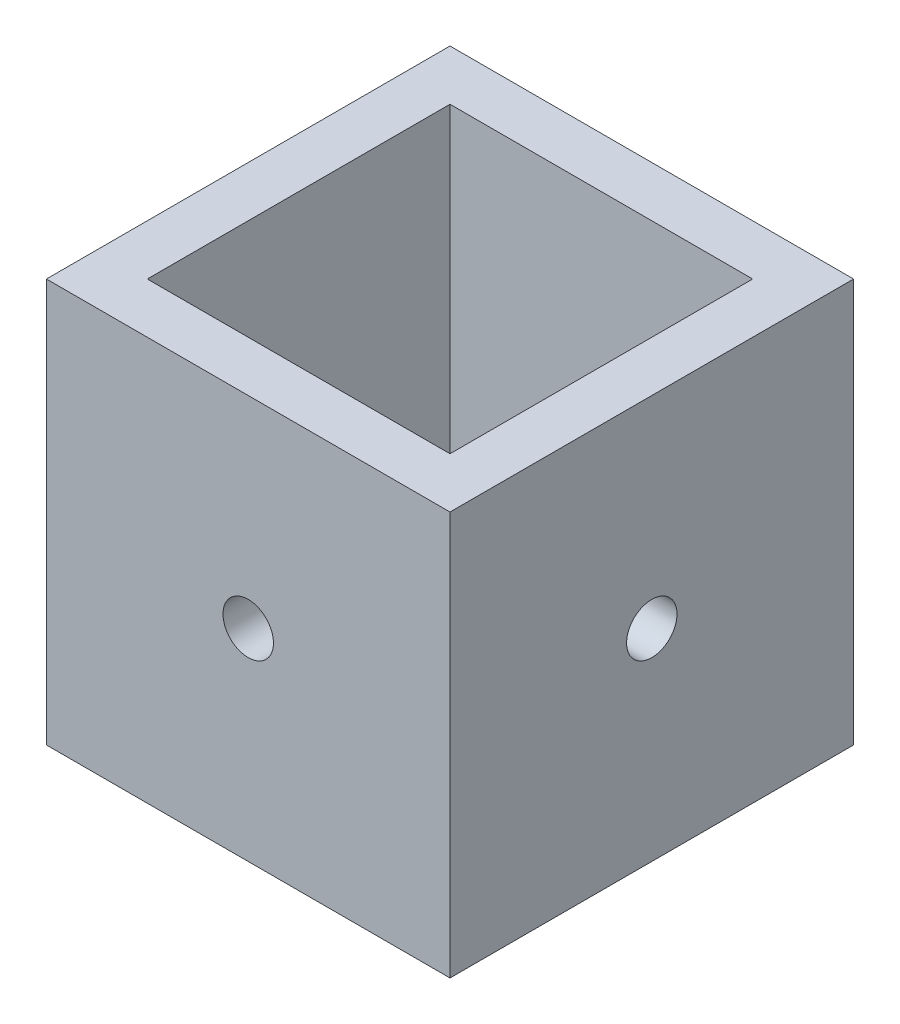
ISO-10303-21;
HEADER;
FILE_DESCRIPTION(('STEP AP214'),'2;1');
FILE_NAME('part.step','',(''),(''),'','','');
FILE_SCHEMA(('AUTOMOTIVE_DESIGN { 1 0 10303 214 1 1 1 1 }'));
ENDSEC;
DATA;
#1=APPLICATION_CONTEXT('core data for automotive mechanical design processes');
#2=APPLICATION_PROTOCOL_DEFINITION('international standard','automotive_design',2000,#1);
#3=PRODUCT_CONTEXT('',#1,'mechanical');
#4=PRODUCT('Part','Part','',(#3));
#5=PRODUCT_RELATED_PRODUCT_CATEGORY('part','',(#4));
#6=PRODUCT_DEFINITION_FORMATION('','',#4);
#7=PRODUCT_DEFINITION_CONTEXT('part definition',#1,'design');
#8=PRODUCT_DEFINITION('design','',#6,#7);
#9=PRODUCT_DEFINITION_SHAPE('','',#8);
#10=(LENGTH_UNIT() NAMED_UNIT(*) SI_UNIT(.MILLI.,.METRE.));
#11=(NAMED_UNIT(*) PLANE_ANGLE_UNIT() SI_UNIT($,.RADIAN.));
#12=(NAMED_UNIT(*) SI_UNIT($,.STERADIAN.) SOLID_ANGLE_UNIT());
#13=UNCERTAINTY_MEASURE_WITH_UNIT(LENGTH_MEASURE(1.E-05),#10,'distance_accuracy_value','');
#14=(GEOMETRIC_REPRESENTATION_CONTEXT(3) GLOBAL_UNCERTAINTY_ASSIGNED_CONTEXT((#13)) GLOBAL_UNIT_ASSIGNED_CONTEXT((#10,
#11,#12)) REPRESENTATION_CONTEXT('',''));
#15=CARTESIAN_POINT('',(0.,0.,0.));
#16=DIRECTION('',(0.,0.,1.));
#17=DIRECTION('',(1.,0.,0.));
#18=AXIS2_PLACEMENT_3D('',#15,#16,#17);
#19=CARTESIAN_POINT('',(0.,25.4,0.));
#20=DIRECTION('',(0.,1.,0.));
#21=DIRECTION('',(0.,0.,1.));
#22=AXIS2_PLACEMENT_3D('',#19,#20,#21);
#23=PLANE('',#22);
#24=DIRECTION('',(0.,0.,1.));
#25=VECTOR('',#24,1.);
#26=CARTESIAN_POINT('',(-12.7,25.4,12.7));
#27=LINE('',#26,#25);
#28=CARTESIAN_POINT('',(-12.7,25.4,-12.7));
#29=VERTEX_POINT('',#28);
#30=CARTESIAN_POINT('',(-12.7,25.4,12.7));
#31=VERTEX_POINT('',#30);
#32=EDGE_CURVE('E157',#29,#31,#27,.T.);
#33=ORIENTED_EDGE('',*,*,#32,.T.);
#34=DIRECTION('',(1.,0.,0.));
#35=VECTOR('',#34,1.);
#36=CARTESIAN_POINT('',(12.7,25.4,12.7));
#37=LINE('',#36,#35);
#38=CARTESIAN_POINT('',(12.7,25.4,12.7));
#39=VERTEX_POINT('',#38);
#40=EDGE_CURVE('E161',#31,#39,#37,.T.);
#41=ORIENTED_EDGE('',*,*,#40,.T.);
#42=DIRECTION('',(0.,0.,-1.));
#43=VECTOR('',#42,1.);
#44=CARTESIAN_POINT('',(12.7,25.4,12.7));
#45=LINE('',#44,#43);
#46=CARTESIAN_POINT('',(12.7,25.4,-12.7));
#47=VERTEX_POINT('',#46);
#48=EDGE_CURVE('E165',#39,#47,#45,.T.);
#49=ORIENTED_EDGE('',*,*,#48,.T.);
#50=DIRECTION('',(-1.,0.,0.));
#51=VECTOR('',#50,1.);
#52=CARTESIAN_POINT('',(12.7,25.4,-12.7));
#53=LINE('',#52,#51);
#54=EDGE_CURVE('E168',#47,#29,#53,.T.);
#55=ORIENTED_EDGE('',*,*,#54,.T.);
#56=EDGE_LOOP('',(#33,#41,#49,#55));
#57=FACE_BOUND('',#56,.T.);
#58=DIRECTION('',(1.,0.,0.));
#59=VECTOR('',#58,1.);
#60=CARTESIAN_POINT('',(9.52500000000001,25.4,9.525));
#61=LINE('',#60,#59);
#62=CARTESIAN_POINT('',(-9.525,25.4,9.52500000000001));
#63=VERTEX_POINT('',#62);
#64=CARTESIAN_POINT('',(9.52500000000001,25.4,9.525));
#65=VERTEX_POINT('',#64);
#66=EDGE_CURVE('E116',#63,#65,#61,.T.);
#67=ORIENTED_EDGE('',*,*,#66,.F.);
#68=DIRECTION('',(0.,0.,1.));
#69=VECTOR('',#68,1.);
#70=CARTESIAN_POINT('',(-9.525,25.4,9.52500000000001));
#71=LINE('',#70,#69);
#72=CARTESIAN_POINT('',(-9.525,25.4,-9.525));
#73=VERTEX_POINT('',#72);
#74=EDGE_CURVE('E107',#73,#63,#71,.T.);
#75=ORIENTED_EDGE('',*,*,#74,.F.);
#76=DIRECTION('',(-1.,0.,0.));
#77=VECTOR('',#76,1.);
#78=CARTESIAN_POINT('',(9.525,25.4,-9.525));
#79=LINE('',#78,#77);
#80=CARTESIAN_POINT('',(9.525,25.4,-9.525));
#81=VERTEX_POINT('',#80);
#82=EDGE_CURVE('E133',#81,#73,#79,.T.);
#83=ORIENTED_EDGE('',*,*,#82,.F.);
#84=DIRECTION('',(0.,0.,-1.));
#85=VECTOR('',#84,1.);
#86=CARTESIAN_POINT('',(9.52500000000001,25.4,9.525));
#87=LINE('',#86,#85);
#88=EDGE_CURVE('E129',#65,#81,#87,.T.);
#89=ORIENTED_EDGE('',*,*,#88,.F.);
#90=EDGE_LOOP('',(#67,#75,#83,#89));
#91=FACE_BOUND('',#90,.T.);
#92=ADVANCED_FACE('F39',(#57,#91),#23,.T.);
#93=CARTESIAN_POINT('',(0.,0.,0.));
#94=DIRECTION('',(0.,1.,0.));
#95=DIRECTION('',(0.,0.,1.));
#96=AXIS2_PLACEMENT_3D('',#93,#94,#95);
#97=PLANE('',#96);
#98=DIRECTION('',(0.,0.,1.));
#99=VECTOR('',#98,1.);
#100=CARTESIAN_POINT('',(-12.7,0.,12.7));
#101=LINE('',#100,#99);
#102=CARTESIAN_POINT('',(-12.7,0.,-12.7));
#103=VERTEX_POINT('',#102);
#104=CARTESIAN_POINT('',(-12.7,0.,12.7));
#105=VERTEX_POINT('',#104);
#106=EDGE_CURVE('E125',#103,#105,#101,.T.);
#107=ORIENTED_EDGE('',*,*,#106,.F.);
#108=DIRECTION('',(-1.,0.,0.));
#109=VECTOR('',#108,1.);
#110=CARTESIAN_POINT('',(12.7,0.,-12.7));
#111=LINE('',#110,#109);
#112=CARTESIAN_POINT('',(12.7,0.,-12.7));
#113=VERTEX_POINT('',#112);
#114=EDGE_CURVE('E162',#113,#103,#111,.T.);
#115=ORIENTED_EDGE('',*,*,#114,.F.);
#116=DIRECTION('',(0.,0.,-1.));
#117=VECTOR('',#116,1.);
#118=CARTESIAN_POINT('',(12.7,0.,12.7));
#119=LINE('',#118,#117);
#120=CARTESIAN_POINT('',(12.7,0.,12.7));
#121=VERTEX_POINT('',#120);
#122=EDGE_CURVE('E178',#121,#113,#119,.T.);
#123=ORIENTED_EDGE('',*,*,#122,.F.);
#124=DIRECTION('',(1.,0.,0.));
#125=VECTOR('',#124,1.);
#126=CARTESIAN_POINT('',(12.7,0.,12.7));
#127=LINE('',#126,#125);
#128=EDGE_CURVE('E175',#105,#121,#127,.T.);
#129=ORIENTED_EDGE('',*,*,#128,.F.);
#130=EDGE_LOOP('',(#107,#115,#123,#129));
#131=FACE_BOUND('',#130,.T.);
#132=DIRECTION('',(0.,0.,1.));
#133=VECTOR('',#132,1.);
#134=CARTESIAN_POINT('',(-9.525,0.,9.52500000000001));
#135=LINE('',#134,#133);
#136=CARTESIAN_POINT('',(-9.525,0.,-9.525));
#137=VERTEX_POINT('',#136);
#138=CARTESIAN_POINT('',(-9.525,0.,9.52500000000001));
#139=VERTEX_POINT('',#138);
#140=EDGE_CURVE('E65',#137,#139,#135,.T.);
#141=ORIENTED_EDGE('',*,*,#140,.T.);
#142=DIRECTION('',(1.,0.,0.));
#143=VECTOR('',#142,1.);
#144=CARTESIAN_POINT('',(9.52500000000001,0.,9.525));
#145=LINE('',#144,#143);
#146=CARTESIAN_POINT('',(9.52500000000001,0.,9.525));
#147=VERTEX_POINT('',#146);
#148=EDGE_CURVE('E123',#139,#147,#145,.T.);
#149=ORIENTED_EDGE('',*,*,#148,.T.);
#150=DIRECTION('',(0.,0.,-1.));
#151=VECTOR('',#150,1.);
#152=CARTESIAN_POINT('',(9.52500000000001,0.,9.525));
#153=LINE('',#152,#151);
#154=CARTESIAN_POINT('',(9.525,0.,-9.525));
#155=VERTEX_POINT('',#154);
#156=EDGE_CURVE('E144',#147,#155,#153,.T.);
#157=ORIENTED_EDGE('',*,*,#156,.T.);
#158=DIRECTION('',(-1.,0.,0.));
#159=VECTOR('',#158,1.);
#160=CARTESIAN_POINT('',(9.525,0.,-9.525));
#161=LINE('',#160,#159);
#162=EDGE_CURVE('E117',#155,#137,#161,.T.);
#163=ORIENTED_EDGE('',*,*,#162,.T.);
#164=EDGE_LOOP('',(#141,#149,#157,#163));
#165=FACE_BOUND('',#164,.T.);
#166=ADVANCED_FACE('F236',(#131,#165),#97,.F.);
#167=CARTESIAN_POINT('',(-12.7,25.4,12.7));
#168=DIRECTION('',(1.,0.,0.));
#169=DIRECTION('',(0.,0.,-1.));
#170=AXIS2_PLACEMENT_3D('',#167,#168,#169);
#171=PLANE('',#170);
#172=CARTESIAN_POINT('',(-12.7,12.7,0.));
#173=DIRECTION('',(1.,0.,0.));
#174=DIRECTION('',(0.,0.,-1.));
#175=AXIS2_PLACEMENT_3D('',#172,#173,#174);
#176=CIRCLE('',#175,1.5875);
#177=CARTESIAN_POINT('',(-12.7,12.7,-1.5875));
#178=VERTEX_POINT('',#177);
#179=EDGE_CURVE('E204',#178,#178,#176,.T.);
#180=ORIENTED_EDGE('',*,*,#179,.T.);
#181=EDGE_LOOP('',(#180));
#182=FACE_BOUND('',#181,.T.);
#183=ORIENTED_EDGE('',*,*,#106,.T.);
#184=DIRECTION('',(0.,-1.,0.));
#185=VECTOR('',#184,1.);
#186=CARTESIAN_POINT('',(-12.7,25.4,12.7));
#187=LINE('',#186,#185);
#188=EDGE_CURVE('E11',#31,#105,#187,.T.);
#189=ORIENTED_EDGE('',*,*,#188,.F.);
#190=ORIENTED_EDGE('',*,*,#32,.F.);
#191=DIRECTION('',(0.,-1.,0.));
#192=VECTOR('',#191,1.);
#193=CARTESIAN_POINT('',(-12.7,25.4,-12.7));
#194=LINE('',#193,#192);
#195=EDGE_CURVE('E171',#29,#103,#194,.T.);
#196=ORIENTED_EDGE('',*,*,#195,.T.);
#197=EDGE_LOOP('',(#183,#189,#190,#196));
#198=FACE_BOUND('',#197,.T.);
#199=ADVANCED_FACE('F41',(#182,#198),#171,.F.);
#200=CARTESIAN_POINT('',(12.7,25.4,12.7));
#201=DIRECTION('',(0.,0.,-1.));
#202=DIRECTION('',(-1.,0.,0.));
#203=AXIS2_PLACEMENT_3D('',#200,#201,#202);
#204=PLANE('',#203);
#205=CARTESIAN_POINT('',(0.,12.7,12.7));
#206=DIRECTION('',(0.,0.,1.));
#207=DIRECTION('',(1.,0.,0.));
#208=AXIS2_PLACEMENT_3D('',#205,#206,#207);
#209=CIRCLE('',#208,1.5875);
#210=CARTESIAN_POINT('',(1.5875,12.7,12.7));
#211=VERTEX_POINT('',#210);
#212=EDGE_CURVE('E196',#211,#211,#209,.T.);
#213=ORIENTED_EDGE('',*,*,#212,.F.);
#214=EDGE_LOOP('',(#213));
#215=FACE_BOUND('',#214,.T.);
#216=ORIENTED_EDGE('',*,*,#128,.T.);
#217=DIRECTION('',(0.,-1.,0.));
#218=VECTOR('',#217,1.);
#219=CARTESIAN_POINT('',(12.7,25.4,12.7));
#220=LINE('',#219,#218);
#221=EDGE_CURVE('E49',#39,#121,#220,.T.);
#222=ORIENTED_EDGE('',*,*,#221,.F.);
#223=ORIENTED_EDGE('',*,*,#40,.F.);
#224=ORIENTED_EDGE('',*,*,#188,.T.);
#225=EDGE_LOOP('',(#216,#222,#223,#224));
#226=FACE_BOUND('',#225,.T.);
#227=ADVANCED_FACE('F251',(#215,#226),#204,.F.);
#228=CARTESIAN_POINT('',(12.7,25.4,12.7));
#229=DIRECTION('',(-1.,0.,0.));
#230=DIRECTION('',(0.,0.,1.));
#231=AXIS2_PLACEMENT_3D('',#228,#229,#230);
#232=PLANE('',#231);
#233=CARTESIAN_POINT('',(12.7,12.7,0.));
#234=DIRECTION('',(1.,0.,0.));
#235=DIRECTION('',(0.,0.,-1.));
#236=AXIS2_PLACEMENT_3D('',#233,#234,#235);
#237=CIRCLE('',#236,1.5875);
#238=CARTESIAN_POINT('',(12.7,12.7,-1.5875));
#239=VERTEX_POINT('',#238);
#240=EDGE_CURVE('E286',#239,#239,#237,.T.);
#241=ORIENTED_EDGE('',*,*,#240,.F.);
#242=EDGE_LOOP('',(#241));
#243=FACE_BOUND('',#242,.T.);
#244=ORIENTED_EDGE('',*,*,#122,.T.);
#245=DIRECTION('',(0.,-1.,0.));
#246=VECTOR('',#245,1.);
#247=CARTESIAN_POINT('',(12.7,25.4,-12.7));
#248=LINE('',#247,#246);
#249=EDGE_CURVE('E186',#47,#113,#248,.T.);
#250=ORIENTED_EDGE('',*,*,#249,.F.);
#251=ORIENTED_EDGE('',*,*,#48,.F.);
#252=ORIENTED_EDGE('',*,*,#221,.T.);
#253=EDGE_LOOP('',(#244,#250,#251,#252));
#254=FACE_BOUND('',#253,.T.);
#255=ADVANCED_FACE('F249',(#243,#254),#232,.F.);
#256=CARTESIAN_POINT('',(12.7,25.4,-12.7));
#257=DIRECTION('',(0.,0.,1.));
#258=DIRECTION('',(1.,0.,0.));
#259=AXIS2_PLACEMENT_3D('',#256,#257,#258);
#260=PLANE('',#259);
#261=CARTESIAN_POINT('',(0.,12.7,-12.7));
#262=DIRECTION('',(0.,0.,1.));
#263=DIRECTION('',(1.,0.,0.));
#264=AXIS2_PLACEMENT_3D('',#261,#262,#263);
#265=CIRCLE('',#264,1.5875);
#266=CARTESIAN_POINT('',(1.5875,12.7,-12.7));
#267=VERTEX_POINT('',#266);
#268=EDGE_CURVE('E141',#267,#267,#265,.T.);
#269=ORIENTED_EDGE('',*,*,#268,.T.);
#270=EDGE_LOOP('',(#269));
#271=FACE_BOUND('',#270,.T.);
#272=ORIENTED_EDGE('',*,*,#114,.T.);
#273=ORIENTED_EDGE('',*,*,#195,.F.);
#274=ORIENTED_EDGE('',*,*,#54,.F.);
#275=ORIENTED_EDGE('',*,*,#249,.T.);
#276=EDGE_LOOP('',(#272,#273,#274,#275));
#277=FACE_BOUND('',#276,.T.);
#278=ADVANCED_FACE('F217',(#271,#277),#260,.F.);
#279=CARTESIAN_POINT('',(-9.525,25.4,9.52500000000001));
#280=DIRECTION('',(1.,0.,0.));
#281=DIRECTION('',(0.,0.,-1.));
#282=AXIS2_PLACEMENT_3D('',#279,#280,#281);
#283=PLANE('',#282);
#284=CARTESIAN_POINT('',(-9.525,12.7,0.));
#285=DIRECTION('',(1.,0.,0.));
#286=DIRECTION('',(0.,0.,-1.));
#287=AXIS2_PLACEMENT_3D('',#284,#285,#286);
#288=CIRCLE('',#287,1.5875);
#289=CARTESIAN_POINT('',(-9.525,12.7,-1.5875));
#290=VERTEX_POINT('',#289);
#291=EDGE_CURVE('E210',#290,#290,#288,.T.);
#292=ORIENTED_EDGE('',*,*,#291,.F.);
#293=EDGE_LOOP('',(#292));
#294=FACE_BOUND('',#293,.T.);
#295=ORIENTED_EDGE('',*,*,#140,.F.);
#296=DIRECTION('',(0.,-1.,0.));
#297=VECTOR('',#296,1.);
#298=CARTESIAN_POINT('',(-9.525,25.4,-9.525));
#299=LINE('',#298,#297);
#300=EDGE_CURVE('E111',#73,#137,#299,.T.);
#301=ORIENTED_EDGE('',*,*,#300,.F.);
#302=ORIENTED_EDGE('',*,*,#74,.T.);
#303=DIRECTION('',(0.,-1.,0.));
#304=VECTOR('',#303,1.);
#305=CARTESIAN_POINT('',(-9.525,25.4,9.52500000000001));
#306=LINE('',#305,#304);
#307=EDGE_CURVE('E110',#63,#139,#306,.T.);
#308=ORIENTED_EDGE('',*,*,#307,.T.);
#309=EDGE_LOOP('',(#295,#301,#302,#308));
#310=FACE_BOUND('',#309,.T.);
#311=ADVANCED_FACE('F109',(#294,#310),#283,.T.);
#312=CARTESIAN_POINT('',(9.52500000000001,25.4,9.525));
#313=DIRECTION('',(0.,0.,-1.));
#314=DIRECTION('',(-1.,0.,0.));
#315=AXIS2_PLACEMENT_3D('',#312,#313,#314);
#316=PLANE('',#315);
#317=CARTESIAN_POINT('',(0.,12.7,9.52500000000001));
#318=DIRECTION('',(0.,0.,-1.));
#319=DIRECTION('',(-1.,0.,0.));
#320=AXIS2_PLACEMENT_3D('',#317,#318,#319);
#321=CIRCLE('',#320,1.5875);
#322=CARTESIAN_POINT('',(-1.5875,12.7,9.52500000000001));
#323=VERTEX_POINT('',#322);
#324=EDGE_CURVE('E195',#323,#323,#321,.T.);
#325=ORIENTED_EDGE('',*,*,#324,.F.);
#326=EDGE_LOOP('',(#325));
#327=FACE_BOUND('',#326,.T.);
#328=ORIENTED_EDGE('',*,*,#148,.F.);
#329=ORIENTED_EDGE('',*,*,#307,.F.);
#330=ORIENTED_EDGE('',*,*,#66,.T.);
#331=DIRECTION('',(0.,-1.,0.));
#332=VECTOR('',#331,1.);
#333=CARTESIAN_POINT('',(9.52500000000001,25.4,9.525));
#334=LINE('',#333,#332);
#335=EDGE_CURVE('E126',#65,#147,#334,.T.);
#336=ORIENTED_EDGE('',*,*,#335,.T.);
#337=EDGE_LOOP('',(#328,#329,#330,#336));
#338=FACE_BOUND('',#337,.T.);
#339=ADVANCED_FACE('F120',(#327,#338),#316,.T.);
#340=CARTESIAN_POINT('',(9.52500000000001,25.4,9.525));
#341=DIRECTION('',(-1.,0.,0.));
#342=DIRECTION('',(0.,0.,1.));
#343=AXIS2_PLACEMENT_3D('',#340,#341,#342);
#344=PLANE('',#343);
#345=CARTESIAN_POINT('',(9.52500000000001,12.7,0.));
#346=DIRECTION('',(-1.,0.,0.));
#347=DIRECTION('',(0.,0.,1.));
#348=AXIS2_PLACEMENT_3D('',#345,#346,#347);
#349=CIRCLE('',#348,1.5875);
#350=CARTESIAN_POINT('',(9.52500000000001,12.7,1.5875));
#351=VERTEX_POINT('',#350);
#352=EDGE_CURVE('E43',#351,#351,#349,.T.);
#353=ORIENTED_EDGE('',*,*,#352,.F.);
#354=EDGE_LOOP('',(#353));
#355=FACE_BOUND('',#354,.T.);
#356=ORIENTED_EDGE('',*,*,#156,.F.);
#357=ORIENTED_EDGE('',*,*,#335,.F.);
#358=ORIENTED_EDGE('',*,*,#88,.T.);
#359=DIRECTION('',(0.,-1.,0.));
#360=VECTOR('',#359,1.);
#361=CARTESIAN_POINT('',(9.525,25.4,-9.525));
#362=LINE('',#361,#360);
#363=EDGE_CURVE('E57',#81,#155,#362,.T.);
#364=ORIENTED_EDGE('',*,*,#363,.T.);
#365=EDGE_LOOP('',(#356,#357,#358,#364));
#366=FACE_BOUND('',#365,.T.);
#367=ADVANCED_FACE('F231',(#355,#366),#344,.T.);
#368=CARTESIAN_POINT('',(9.525,25.4,-9.525));
#369=DIRECTION('',(0.,0.,1.));
#370=DIRECTION('',(1.,0.,0.));
#371=AXIS2_PLACEMENT_3D('',#368,#369,#370);
#372=PLANE('',#371);
#373=CARTESIAN_POINT('',(0.,12.7,-9.525));
#374=DIRECTION('',(0.,0.,1.));
#375=DIRECTION('',(1.,0.,0.));
#376=AXIS2_PLACEMENT_3D('',#373,#374,#375);
#377=CIRCLE('',#376,1.5875);
#378=CARTESIAN_POINT('',(1.5875,12.7,-9.525));
#379=VERTEX_POINT('',#378);
#380=EDGE_CURVE('E192',#379,#379,#377,.T.);
#381=ORIENTED_EDGE('',*,*,#380,.F.);
#382=EDGE_LOOP('',(#381));
#383=FACE_BOUND('',#382,.T.);
#384=ORIENTED_EDGE('',*,*,#162,.F.);
#385=ORIENTED_EDGE('',*,*,#363,.F.);
#386=ORIENTED_EDGE('',*,*,#82,.T.);
#387=ORIENTED_EDGE('',*,*,#300,.T.);
#388=EDGE_LOOP('',(#384,#385,#386,#387));
#389=FACE_BOUND('',#388,.T.);
#390=ADVANCED_FACE('F223',(#383,#389),#372,.T.);
#391=CARTESIAN_POINT('',(0.,12.7,-17.78));
#392=DIRECTION('',(0.,0.,1.));
#393=DIRECTION('',(1.,0.,0.));
#394=AXIS2_PLACEMENT_3D('',#391,#392,#393);
#395=CYLINDRICAL_SURFACE('',#394,1.5875);
#396=ORIENTED_EDGE('',*,*,#380,.T.);
#397=EDGE_LOOP('',(#396));
#398=FACE_BOUND('',#397,.T.);
#399=ORIENTED_EDGE('',*,*,#268,.F.);
#400=EDGE_LOOP('',(#399));
#401=FACE_BOUND('',#400,.T.);
#402=ADVANCED_FACE('F220',(#398,#401),#395,.F.);
#403=ORIENTED_EDGE('',*,*,#324,.T.);
#404=EDGE_LOOP('',(#403));
#405=FACE_BOUND('',#404,.T.);
#406=ORIENTED_EDGE('',*,*,#212,.T.);
#407=EDGE_LOOP('',(#406));
#408=FACE_BOUND('',#407,.T.);
#409=ADVANCED_FACE('F222',(#405,#408),#395,.F.);
#410=CARTESIAN_POINT('',(-17.78,12.7,0.));
#411=DIRECTION('',(1.,0.,0.));
#412=DIRECTION('',(0.,0.,-1.));
#413=AXIS2_PLACEMENT_3D('',#410,#411,#412);
#414=CYLINDRICAL_SURFACE('',#413,1.5875);
#415=ORIENTED_EDGE('',*,*,#352,.T.);
#416=EDGE_LOOP('',(#415));
#417=FACE_BOUND('',#416,.T.);
#418=ORIENTED_EDGE('',*,*,#240,.T.);
#419=EDGE_LOOP('',(#418));
#420=FACE_BOUND('',#419,.T.);
#421=ADVANCED_FACE('F229',(#417,#420),#414,.F.);
#422=ORIENTED_EDGE('',*,*,#291,.T.);
#423=EDGE_LOOP('',(#422));
#424=FACE_BOUND('',#423,.T.);
#425=ORIENTED_EDGE('',*,*,#179,.F.);
#426=EDGE_LOOP('',(#425));
#427=FACE_BOUND('',#426,.T.);
#428=ADVANCED_FACE('F295',(#424,#427),#414,.F.);
#429=CLOSED_SHELL('',(#92,#166,#199,#227,#255,#278,#311,#339,#367,#390,#402,#409,#421,#428));
#430=MANIFOLD_SOLID_BREP('B2',#429);
#431=ADVANCED_BREP_SHAPE_REPRESENTATION('',(#18,#430),#14);
#432=SHAPE_DEFINITION_REPRESENTATION(#9,#431);
ENDSEC;
END-ISO-10303-21;
